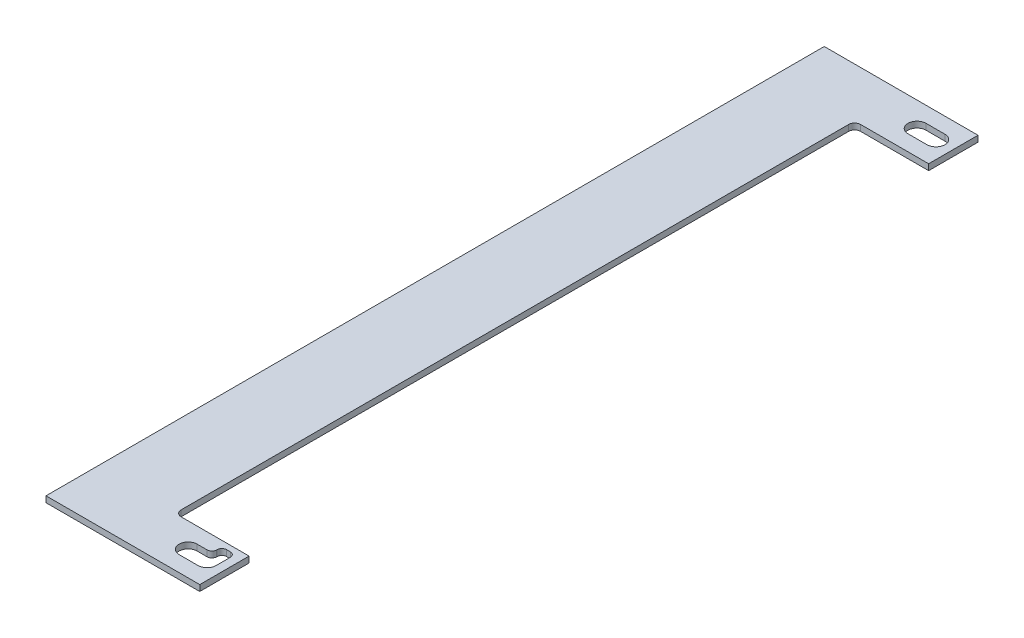
ISO-10303-21;
HEADER;
FILE_DESCRIPTION(('STEP AP214'),'2;1');
FILE_NAME('part.step','',(''),(''),'','','');
FILE_SCHEMA(('AUTOMOTIVE_DESIGN { 1 0 10303 214 1 1 1 1 }'));
ENDSEC;
DATA;
#1=APPLICATION_CONTEXT('core data for automotive mechanical design processes');
#2=APPLICATION_PROTOCOL_DEFINITION('international standard','automotive_design',2000,#1);
#3=PRODUCT_CONTEXT('',#1,'mechanical');
#4=PRODUCT('Part','Part','',(#3));
#5=PRODUCT_RELATED_PRODUCT_CATEGORY('part','',(#4));
#6=PRODUCT_DEFINITION_FORMATION('','',#4);
#7=PRODUCT_DEFINITION_CONTEXT('part definition',#1,'design');
#8=PRODUCT_DEFINITION('design','',#6,#7);
#9=PRODUCT_DEFINITION_SHAPE('','',#8);
#10=(LENGTH_UNIT() NAMED_UNIT(*) SI_UNIT(.MILLI.,.METRE.));
#11=(NAMED_UNIT(*) PLANE_ANGLE_UNIT() SI_UNIT($,.RADIAN.));
#12=(NAMED_UNIT(*) SI_UNIT($,.STERADIAN.) SOLID_ANGLE_UNIT());
#13=UNCERTAINTY_MEASURE_WITH_UNIT(LENGTH_MEASURE(1.E-05),#10,'distance_accuracy_value','');
#14=(GEOMETRIC_REPRESENTATION_CONTEXT(3) GLOBAL_UNCERTAINTY_ASSIGNED_CONTEXT((#13)) GLOBAL_UNIT_ASSIGNED_CONTEXT((#10,
#11,#12)) REPRESENTATION_CONTEXT('',''));
#15=CARTESIAN_POINT('',(0.,0.,0.));
#16=DIRECTION('',(0.,0.,1.));
#17=DIRECTION('',(1.,0.,0.));
#18=AXIS2_PLACEMENT_3D('',#15,#16,#17);
#19=CARTESIAN_POINT('',(2.,3.175,140.70025));
#20=DIRECTION('',(0.,-1.,0.));
#21=DIRECTION('',(0.,0.,-1.));
#22=AXIS2_PLACEMENT_3D('',#19,#20,#21);
#23=CYLINDRICAL_SURFACE('',#22,4.76250000000002);
#24=CARTESIAN_POINT('',(2.,3.175,140.70025));
#25=DIRECTION('',(0.,1.,0.));
#26=DIRECTION('',(0.,0.,1.));
#27=AXIS2_PLACEMENT_3D('',#24,#25,#26);
#28=CIRCLE('',#27,4.76250000000002);
#29=CARTESIAN_POINT('',(2.,3.175,145.46275));
#30=VERTEX_POINT('',#29);
#31=CARTESIAN_POINT('',(6.76250000000002,3.175,140.70025));
#32=VERTEX_POINT('',#31);
#33=EDGE_CURVE('E214',#30,#32,#28,.T.);
#34=ORIENTED_EDGE('',*,*,#33,.T.);
#35=DIRECTION('',(0.,1.,0.));
#36=VECTOR('',#35,1.);
#37=CARTESIAN_POINT('',(6.76250000000002,0.,140.70025));
#38=LINE('',#37,#36);
#39=CARTESIAN_POINT('',(6.76250000000002,0.,140.70025));
#40=VERTEX_POINT('',#39);
#41=EDGE_CURVE('E197',#40,#32,#38,.T.);
#42=ORIENTED_EDGE('',*,*,#41,.F.);
#43=CARTESIAN_POINT('',(2.,0.,140.70025));
#44=DIRECTION('',(0.,1.,0.));
#45=DIRECTION('',(0.,0.,1.));
#46=AXIS2_PLACEMENT_3D('',#43,#44,#45);
#47=CIRCLE('',#46,4.76250000000002);
#48=CARTESIAN_POINT('',(2.,0.,145.46275));
#49=VERTEX_POINT('',#48);
#50=EDGE_CURVE('E211',#49,#40,#47,.T.);
#51=ORIENTED_EDGE('',*,*,#50,.F.);
#52=DIRECTION('',(0.,-1.,0.));
#53=VECTOR('',#52,1.);
#54=CARTESIAN_POINT('',(2.,3.175,145.46275));
#55=LINE('',#54,#53);
#56=EDGE_CURVE('E232',#30,#49,#55,.T.);
#57=ORIENTED_EDGE('',*,*,#56,.F.);
#58=EDGE_LOOP('',(#34,#42,#51,#57));
#59=FACE_BOUND('',#58,.T.);
#60=ADVANCED_FACE('F34',(#59),#23,.F.);
#61=CARTESIAN_POINT('',(-69.865,3.175,153.70025));
#62=DIRECTION('',(0.,1.,0.));
#63=DIRECTION('',(0.,0.,1.));
#64=AXIS2_PLACEMENT_3D('',#61,#62,#63);
#65=PLANE('',#64);
#66=DIRECTION('',(-1.,0.,0.));
#67=VECTOR('',#66,1.);
#68=CARTESIAN_POINT('',(-8.,3.175,135.93775));
#69=LINE('',#68,#67);
#70=CARTESIAN_POINT('',(-2.73749999999998,3.175,135.93775));
#71=VERTEX_POINT('',#70);
#72=CARTESIAN_POINT('',(-8.,3.175,135.93775));
#73=VERTEX_POINT('',#72);
#74=EDGE_CURVE('E233',#71,#73,#69,.T.);
#75=ORIENTED_EDGE('',*,*,#74,.F.);
#76=CARTESIAN_POINT('',(-2.73749999999999,3.175,133.43775));
#77=DIRECTION('',(0.,1.,0.));
#78=DIRECTION('',(0.,0.,1.));
#79=AXIS2_PLACEMENT_3D('',#76,#77,#78);
#80=CIRCLE('',#79,2.5);
#81=CARTESIAN_POINT('',(-0.237499999999987,3.175,133.43775));
#82=VERTEX_POINT('',#81);
#83=EDGE_CURVE('E339',#71,#82,#80,.T.);
#84=ORIENTED_EDGE('',*,*,#83,.T.);
#85=DIRECTION('',(0.,0.,1.));
#86=VECTOR('',#85,1.);
#87=CARTESIAN_POINT('',(-0.237499999999987,3.175,135.93775));
#88=LINE('',#87,#86);
#89=CARTESIAN_POINT('',(-0.237499999999987,3.175,133.20025));
#90=VERTEX_POINT('',#89);
#91=EDGE_CURVE('E205',#90,#82,#88,.T.);
#92=ORIENTED_EDGE('',*,*,#91,.F.);
#93=CARTESIAN_POINT('',(2.26250000000001,3.175,133.20025));
#94=DIRECTION('',(0.,1.,0.));
#95=DIRECTION('',(0.,0.,1.));
#96=AXIS2_PLACEMENT_3D('',#93,#94,#95);
#97=CIRCLE('',#96,2.5);
#98=CARTESIAN_POINT('',(2.26250000000001,3.175,130.70025));
#99=VERTEX_POINT('',#98);
#100=EDGE_CURVE('E347',#90,#99,#97,.F.);
#101=ORIENTED_EDGE('',*,*,#100,.T.);
#102=DIRECTION('',(-1.,0.,0.));
#103=VECTOR('',#102,1.);
#104=CARTESIAN_POINT('',(-0.237499999999987,3.175,130.70025));
#105=LINE('',#104,#103);
#106=CARTESIAN_POINT('',(4.26250000000001,3.175,130.70025));
#107=VERTEX_POINT('',#106);
#108=EDGE_CURVE('E492',#107,#99,#105,.T.);
#109=ORIENTED_EDGE('',*,*,#108,.F.);
#110=CARTESIAN_POINT('',(4.26250000000001,3.175,133.20025));
#111=DIRECTION('',(0.,1.,0.));
#112=DIRECTION('',(0.,0.,1.));
#113=AXIS2_PLACEMENT_3D('',#110,#111,#112);
#114=CIRCLE('',#113,2.5);
#115=CARTESIAN_POINT('',(6.76250000000001,3.175,133.20025));
#116=VERTEX_POINT('',#115);
#117=EDGE_CURVE('E343',#107,#116,#114,.F.);
#118=ORIENTED_EDGE('',*,*,#117,.T.);
#119=DIRECTION('',(0.,0.,-1.));
#120=VECTOR('',#119,1.);
#121=CARTESIAN_POINT('',(6.76250000000001,3.175,130.70025));
#122=LINE('',#121,#120);
#123=EDGE_CURVE('E490',#32,#116,#122,.T.);
#124=ORIENTED_EDGE('',*,*,#123,.F.);
#125=ORIENTED_EDGE('',*,*,#33,.F.);
#126=DIRECTION('',(1.,0.,0.));
#127=VECTOR('',#126,1.);
#128=CARTESIAN_POINT('',(-8.,3.175,145.46275));
#129=LINE('',#128,#127);
#130=CARTESIAN_POINT('',(-8.,3.175,145.46275));
#131=VERTEX_POINT('',#130);
#132=EDGE_CURVE('E497',#131,#30,#129,.T.);
#133=ORIENTED_EDGE('',*,*,#132,.F.);
#134=CARTESIAN_POINT('',(-8.,3.175,140.70025));
#135=DIRECTION('',(0.,1.,0.));
#136=DIRECTION('',(0.,0.,1.));
#137=AXIS2_PLACEMENT_3D('',#134,#135,#136);
#138=CIRCLE('',#137,4.76250000000002);
#139=EDGE_CURVE('E224',#73,#131,#138,.T.);
#140=ORIENTED_EDGE('',*,*,#139,.F.);
#141=EDGE_LOOP('',(#75,#84,#92,#101,#109,#118,#124,#125,#133,#140));
#142=FACE_BOUND('',#141,.T.);
#143=DIRECTION('',(-1.,0.,0.));
#144=VECTOR('',#143,1.);
#145=CARTESIAN_POINT('',(-8.,3.175,-248.06225));
#146=LINE('',#145,#144);
#147=CARTESIAN_POINT('',(2.,3.175,-248.06225));
#148=VERTEX_POINT('',#147);
#149=CARTESIAN_POINT('',(-8.,3.175,-248.06225));
#150=VERTEX_POINT('',#149);
#151=EDGE_CURVE('E241',#148,#150,#146,.T.);
#152=ORIENTED_EDGE('',*,*,#151,.F.);
#153=CARTESIAN_POINT('',(2.,3.175,-243.29975));
#154=DIRECTION('',(0.,1.,0.));
#155=DIRECTION('',(0.,0.,1.));
#156=AXIS2_PLACEMENT_3D('',#153,#154,#155);
#157=CIRCLE('',#156,4.7625);
#158=CARTESIAN_POINT('',(2.,3.175,-238.53725));
#159=VERTEX_POINT('',#158);
#160=EDGE_CURVE('E239',#159,#148,#157,.T.);
#161=ORIENTED_EDGE('',*,*,#160,.F.);
#162=DIRECTION('',(1.,0.,0.));
#163=VECTOR('',#162,1.);
#164=CARTESIAN_POINT('',(-8.,3.175,-238.53725));
#165=LINE('',#164,#163);
#166=CARTESIAN_POINT('',(-8.,3.175,-238.53725));
#167=VERTEX_POINT('',#166);
#168=EDGE_CURVE('E247',#167,#159,#165,.T.);
#169=ORIENTED_EDGE('',*,*,#168,.F.);
#170=CARTESIAN_POINT('',(-8.,3.175,-243.29975));
#171=DIRECTION('',(0.,1.,0.));
#172=DIRECTION('',(0.,0.,1.));
#173=AXIS2_PLACEMENT_3D('',#170,#171,#172);
#174=CIRCLE('',#173,4.7625);
#175=EDGE_CURVE('E244',#150,#167,#174,.T.);
#176=ORIENTED_EDGE('',*,*,#175,.F.);
#177=EDGE_LOOP('',(#152,#161,#169,#176));
#178=FACE_BOUND('',#177,.T.);
#179=DIRECTION('',(0.,0.,1.));
#180=VECTOR('',#179,1.);
#181=CARTESIAN_POINT('',(-69.865,3.175,-256.29975));
#182=LINE('',#181,#180);
#183=CARTESIAN_POINT('',(-69.865,3.175,-256.29975));
#184=VERTEX_POINT('',#183);
#185=CARTESIAN_POINT('',(-69.865,3.175,153.70025));
#186=VERTEX_POINT('',#185);
#187=EDGE_CURVE('E270',#184,#186,#182,.T.);
#188=ORIENTED_EDGE('',*,*,#187,.T.);
#189=DIRECTION('',(1.,0.,0.));
#190=VECTOR('',#189,1.);
#191=CARTESIAN_POINT('',(-69.865,3.175,153.70025));
#192=LINE('',#191,#190);
#193=CARTESIAN_POINT('',(11.1350000000001,3.175,153.70025));
#194=VERTEX_POINT('',#193);
#195=EDGE_CURVE('E273',#186,#194,#192,.T.);
#196=ORIENTED_EDGE('',*,*,#195,.T.);
#197=DIRECTION('',(0.,0.,-1.));
#198=VECTOR('',#197,1.);
#199=CARTESIAN_POINT('',(11.1350000000001,3.175,145.46275));
#200=LINE('',#199,#198);
#201=CARTESIAN_POINT('',(11.1350000000001,3.175,127.70025));
#202=VERTEX_POINT('',#201);
#203=EDGE_CURVE('E276',#194,#202,#200,.T.);
#204=ORIENTED_EDGE('',*,*,#203,.T.);
#205=DIRECTION('',(-1.,0.,0.));
#206=VECTOR('',#205,1.);
#207=CARTESIAN_POINT('',(-27.865,3.175,127.70025));
#208=LINE('',#207,#206);
#209=CARTESIAN_POINT('',(-24.69,3.175,127.70025));
#210=VERTEX_POINT('',#209);
#211=EDGE_CURVE('E278',#202,#210,#208,.T.);
#212=ORIENTED_EDGE('',*,*,#211,.T.);
#213=CARTESIAN_POINT('',(-24.69,3.175,124.52525));
#214=DIRECTION('',(0.,1.,0.));
#215=DIRECTION('',(0.,0.,1.));
#216=AXIS2_PLACEMENT_3D('',#213,#214,#215);
#217=CIRCLE('',#216,3.175);
#218=CARTESIAN_POINT('',(-27.865,3.175,124.52525));
#219=VERTEX_POINT('',#218);
#220=EDGE_CURVE('E362',#210,#219,#217,.F.);
#221=ORIENTED_EDGE('',*,*,#220,.T.);
#222=DIRECTION('',(0.,0.,-1.));
#223=VECTOR('',#222,1.);
#224=CARTESIAN_POINT('',(-27.865,3.175,-230.29975));
#225=LINE('',#224,#223);
#226=CARTESIAN_POINT('',(-27.865,3.175,-227.12475));
#227=VERTEX_POINT('',#226);
#228=EDGE_CURVE('E281',#219,#227,#225,.T.);
#229=ORIENTED_EDGE('',*,*,#228,.T.);
#230=CARTESIAN_POINT('',(-24.69,3.175,-227.12475));
#231=DIRECTION('',(0.,1.,0.));
#232=DIRECTION('',(0.,0.,1.));
#233=AXIS2_PLACEMENT_3D('',#230,#231,#232);
#234=CIRCLE('',#233,3.175);
#235=CARTESIAN_POINT('',(-24.69,3.175,-230.29975));
#236=VERTEX_POINT('',#235);
#237=EDGE_CURVE('E11',#227,#236,#234,.F.);
#238=ORIENTED_EDGE('',*,*,#237,.T.);
#239=DIRECTION('',(1.,0.,0.));
#240=VECTOR('',#239,1.);
#241=CARTESIAN_POINT('',(11.135,3.175,-230.29975));
#242=LINE('',#241,#240);
#243=CARTESIAN_POINT('',(11.135,3.175,-230.29975));
#244=VERTEX_POINT('',#243);
#245=EDGE_CURVE('E283',#236,#244,#242,.T.);
#246=ORIENTED_EDGE('',*,*,#245,.T.);
#247=DIRECTION('',(0.,0.,-1.));
#248=VECTOR('',#247,1.);
#249=CARTESIAN_POINT('',(11.135,3.175,-238.53725));
#250=LINE('',#249,#248);
#251=CARTESIAN_POINT('',(11.135,3.175,-256.29975));
#252=VERTEX_POINT('',#251);
#253=EDGE_CURVE('E285',#244,#252,#250,.T.);
#254=ORIENTED_EDGE('',*,*,#253,.T.);
#255=DIRECTION('',(-1.,0.,0.));
#256=VECTOR('',#255,1.);
#257=CARTESIAN_POINT('',(-69.865,3.175,-256.29975));
#258=LINE('',#257,#256);
#259=EDGE_CURVE('E287',#252,#184,#258,.T.);
#260=ORIENTED_EDGE('',*,*,#259,.T.);
#261=EDGE_LOOP('',(#188,#196,#204,#212,#221,#229,#238,#246,#254,#260));
#262=FACE_BOUND('',#261,.T.);
#263=ADVANCED_FACE('F376',(#142,#178,#262),#65,.T.);
#264=CARTESIAN_POINT('',(-69.865,0.,153.70025));
#265=DIRECTION('',(0.,1.,0.));
#266=DIRECTION('',(0.,0.,1.));
#267=AXIS2_PLACEMENT_3D('',#264,#265,#266);
#268=PLANE('',#267);
#269=CARTESIAN_POINT('',(2.,0.,-243.29975));
#270=DIRECTION('',(0.,1.,0.));
#271=DIRECTION('',(0.,0.,1.));
#272=AXIS2_PLACEMENT_3D('',#269,#270,#271);
#273=CIRCLE('',#272,4.7625);
#274=CARTESIAN_POINT('',(2.,0.,-238.53725));
#275=VERTEX_POINT('',#274);
#276=CARTESIAN_POINT('',(2.,0.,-248.06225));
#277=VERTEX_POINT('',#276);
#278=EDGE_CURVE('E238',#275,#277,#273,.T.);
#279=ORIENTED_EDGE('',*,*,#278,.T.);
#280=DIRECTION('',(-1.,0.,0.));
#281=VECTOR('',#280,1.);
#282=CARTESIAN_POINT('',(-8.,0.,-248.06225));
#283=LINE('',#282,#281);
#284=CARTESIAN_POINT('',(-8.,0.,-248.06225));
#285=VERTEX_POINT('',#284);
#286=EDGE_CURVE('E252',#277,#285,#283,.T.);
#287=ORIENTED_EDGE('',*,*,#286,.T.);
#288=CARTESIAN_POINT('',(-8.,0.,-243.29975));
#289=DIRECTION('',(0.,1.,0.));
#290=DIRECTION('',(0.,0.,1.));
#291=AXIS2_PLACEMENT_3D('',#288,#289,#290);
#292=CIRCLE('',#291,4.7625);
#293=CARTESIAN_POINT('',(-8.,0.,-238.53725));
#294=VERTEX_POINT('',#293);
#295=EDGE_CURVE('E255',#285,#294,#292,.T.);
#296=ORIENTED_EDGE('',*,*,#295,.T.);
#297=DIRECTION('',(1.,0.,0.));
#298=VECTOR('',#297,1.);
#299=CARTESIAN_POINT('',(-8.,0.,-238.53725));
#300=LINE('',#299,#298);
#301=EDGE_CURVE('E242',#294,#275,#300,.T.);
#302=ORIENTED_EDGE('',*,*,#301,.T.);
#303=EDGE_LOOP('',(#279,#287,#296,#302));
#304=FACE_BOUND('',#303,.T.);
#305=DIRECTION('',(0.,0.,1.));
#306=VECTOR('',#305,1.);
#307=CARTESIAN_POINT('',(-69.865,0.,-256.29975));
#308=LINE('',#307,#306);
#309=CARTESIAN_POINT('',(-69.865,0.,-256.29975));
#310=VERTEX_POINT('',#309);
#311=CARTESIAN_POINT('',(-69.865,0.,153.70025));
#312=VERTEX_POINT('',#311);
#313=EDGE_CURVE('E269',#310,#312,#308,.T.);
#314=ORIENTED_EDGE('',*,*,#313,.F.);
#315=DIRECTION('',(-1.,0.,0.));
#316=VECTOR('',#315,1.);
#317=CARTESIAN_POINT('',(-69.865,0.,-256.29975));
#318=LINE('',#317,#316);
#319=CARTESIAN_POINT('',(11.135,0.,-256.29975));
#320=VERTEX_POINT('',#319);
#321=EDGE_CURVE('E274',#320,#310,#318,.T.);
#322=ORIENTED_EDGE('',*,*,#321,.F.);
#323=DIRECTION('',(0.,0.,-1.));
#324=VECTOR('',#323,1.);
#325=CARTESIAN_POINT('',(11.135,0.,-256.29975));
#326=LINE('',#325,#324);
#327=CARTESIAN_POINT('',(11.135,0.,-230.29975));
#328=VERTEX_POINT('',#327);
#329=EDGE_CURVE('E305',#328,#320,#326,.T.);
#330=ORIENTED_EDGE('',*,*,#329,.F.);
#331=DIRECTION('',(1.,0.,0.));
#332=VECTOR('',#331,1.);
#333=CARTESIAN_POINT('',(11.135,0.,-230.29975));
#334=LINE('',#333,#332);
#335=CARTESIAN_POINT('',(-24.69,0.,-230.29975));
#336=VERTEX_POINT('',#335);
#337=EDGE_CURVE('E303',#336,#328,#334,.T.);
#338=ORIENTED_EDGE('',*,*,#337,.F.);
#339=CARTESIAN_POINT('',(-24.69,0.,-227.12475));
#340=DIRECTION('',(0.,1.,0.));
#341=DIRECTION('',(0.,0.,1.));
#342=AXIS2_PLACEMENT_3D('',#339,#340,#341);
#343=CIRCLE('',#342,3.175);
#344=CARTESIAN_POINT('',(-27.865,0.,-227.12475));
#345=VERTEX_POINT('',#344);
#346=EDGE_CURVE('E42',#336,#345,#343,.T.);
#347=ORIENTED_EDGE('',*,*,#346,.T.);
#348=DIRECTION('',(0.,0.,-1.));
#349=VECTOR('',#348,1.);
#350=CARTESIAN_POINT('',(-27.865,0.,-230.29975));
#351=LINE('',#350,#349);
#352=CARTESIAN_POINT('',(-27.865,0.,124.52525));
#353=VERTEX_POINT('',#352);
#354=EDGE_CURVE('E300',#353,#345,#351,.T.);
#355=ORIENTED_EDGE('',*,*,#354,.F.);
#356=CARTESIAN_POINT('',(-24.69,0.,124.52525));
#357=DIRECTION('',(0.,1.,0.));
#358=DIRECTION('',(0.,0.,1.));
#359=AXIS2_PLACEMENT_3D('',#356,#357,#358);
#360=CIRCLE('',#359,3.175);
#361=CARTESIAN_POINT('',(-24.69,0.,127.70025));
#362=VERTEX_POINT('',#361);
#363=EDGE_CURVE('E360',#353,#362,#360,.T.);
#364=ORIENTED_EDGE('',*,*,#363,.T.);
#365=DIRECTION('',(-1.,0.,0.));
#366=VECTOR('',#365,1.);
#367=CARTESIAN_POINT('',(-27.865,0.,127.70025));
#368=LINE('',#367,#366);
#369=CARTESIAN_POINT('',(11.1350000000001,0.,127.70025));
#370=VERTEX_POINT('',#369);
#371=EDGE_CURVE('E297',#370,#362,#368,.T.);
#372=ORIENTED_EDGE('',*,*,#371,.F.);
#373=DIRECTION('',(0.,0.,-1.));
#374=VECTOR('',#373,1.);
#375=CARTESIAN_POINT('',(11.1350000000001,0.,127.70025));
#376=LINE('',#375,#374);
#377=CARTESIAN_POINT('',(11.1350000000001,0.,153.70025));
#378=VERTEX_POINT('',#377);
#379=EDGE_CURVE('E295',#378,#370,#376,.T.);
#380=ORIENTED_EDGE('',*,*,#379,.F.);
#381=DIRECTION('',(1.,0.,0.));
#382=VECTOR('',#381,1.);
#383=CARTESIAN_POINT('',(-69.865,0.,153.70025));
#384=LINE('',#383,#382);
#385=EDGE_CURVE('E292',#312,#378,#384,.T.);
#386=ORIENTED_EDGE('',*,*,#385,.F.);
#387=EDGE_LOOP('',(#314,#322,#330,#338,#347,#355,#364,#372,#380,#386));
#388=FACE_BOUND('',#387,.T.);
#389=DIRECTION('',(0.,0.,1.));
#390=VECTOR('',#389,1.);
#391=CARTESIAN_POINT('',(-0.237499999999987,0.,135.93775));
#392=LINE('',#391,#390);
#393=CARTESIAN_POINT('',(-0.237499999999987,0.,133.20025));
#394=VERTEX_POINT('',#393);
#395=CARTESIAN_POINT('',(-0.237499999999987,0.,133.43775));
#396=VERTEX_POINT('',#395);
#397=EDGE_CURVE('E216',#394,#396,#392,.T.);
#398=ORIENTED_EDGE('',*,*,#397,.T.);
#399=CARTESIAN_POINT('',(-2.73749999999999,0.,133.43775));
#400=DIRECTION('',(0.,1.,0.));
#401=DIRECTION('',(0.,0.,1.));
#402=AXIS2_PLACEMENT_3D('',#399,#400,#401);
#403=CIRCLE('',#402,2.5);
#404=CARTESIAN_POINT('',(-2.73749999999998,0.,135.93775));
#405=VERTEX_POINT('',#404);
#406=EDGE_CURVE('E341',#396,#405,#403,.F.);
#407=ORIENTED_EDGE('',*,*,#406,.T.);
#408=DIRECTION('',(-1.,0.,0.));
#409=VECTOR('',#408,1.);
#410=CARTESIAN_POINT('',(-8.,0.,135.93775));
#411=LINE('',#410,#409);
#412=CARTESIAN_POINT('',(-8.,0.,135.93775));
#413=VERTEX_POINT('',#412);
#414=EDGE_CURVE('E222',#405,#413,#411,.T.);
#415=ORIENTED_EDGE('',*,*,#414,.T.);
#416=CARTESIAN_POINT('',(-8.,0.,140.70025));
#417=DIRECTION('',(0.,1.,0.));
#418=DIRECTION('',(0.,0.,1.));
#419=AXIS2_PLACEMENT_3D('',#416,#417,#418);
#420=CIRCLE('',#419,4.76250000000002);
#421=CARTESIAN_POINT('',(-8.,0.,145.46275));
#422=VERTEX_POINT('',#421);
#423=EDGE_CURVE('E215',#413,#422,#420,.T.);
#424=ORIENTED_EDGE('',*,*,#423,.T.);
#425=DIRECTION('',(1.,0.,0.));
#426=VECTOR('',#425,1.);
#427=CARTESIAN_POINT('',(-8.,0.,145.46275));
#428=LINE('',#427,#426);
#429=EDGE_CURVE('E221',#422,#49,#428,.T.);
#430=ORIENTED_EDGE('',*,*,#429,.T.);
#431=ORIENTED_EDGE('',*,*,#50,.T.);
#432=DIRECTION('',(0.,0.,-1.));
#433=VECTOR('',#432,1.);
#434=CARTESIAN_POINT('',(6.76250000000001,0.,130.70025));
#435=LINE('',#434,#433);
#436=CARTESIAN_POINT('',(6.76250000000001,0.,133.20025));
#437=VERTEX_POINT('',#436);
#438=EDGE_CURVE('E193',#40,#437,#435,.T.);
#439=ORIENTED_EDGE('',*,*,#438,.T.);
#440=CARTESIAN_POINT('',(4.26250000000001,0.,133.20025));
#441=DIRECTION('',(0.,1.,0.));
#442=DIRECTION('',(0.,0.,1.));
#443=AXIS2_PLACEMENT_3D('',#440,#441,#442);
#444=CIRCLE('',#443,2.5);
#445=CARTESIAN_POINT('',(4.26250000000001,0.,130.70025));
#446=VERTEX_POINT('',#445);
#447=EDGE_CURVE('E345',#437,#446,#444,.T.);
#448=ORIENTED_EDGE('',*,*,#447,.T.);
#449=DIRECTION('',(-1.,0.,0.));
#450=VECTOR('',#449,1.);
#451=CARTESIAN_POINT('',(-0.237499999999987,0.,130.70025));
#452=LINE('',#451,#450);
#453=CARTESIAN_POINT('',(2.26250000000001,0.,130.70025));
#454=VERTEX_POINT('',#453);
#455=EDGE_CURVE('E204',#446,#454,#452,.T.);
#456=ORIENTED_EDGE('',*,*,#455,.T.);
#457=CARTESIAN_POINT('',(2.26250000000001,0.,133.20025));
#458=DIRECTION('',(0.,1.,0.));
#459=DIRECTION('',(0.,0.,1.));
#460=AXIS2_PLACEMENT_3D('',#457,#458,#459);
#461=CIRCLE('',#460,2.5);
#462=EDGE_CURVE('E349',#454,#394,#461,.T.);
#463=ORIENTED_EDGE('',*,*,#462,.T.);
#464=EDGE_LOOP('',(#398,#407,#415,#424,#430,#431,#439,#448,#456,#463));
#465=FACE_BOUND('',#464,.T.);
#466=ADVANCED_FACE('F219',(#304,#388,#465),#268,.F.);
#467=CARTESIAN_POINT('',(-69.865,3.175,-256.29975));
#468=DIRECTION('',(1.,0.,0.));
#469=DIRECTION('',(0.,0.,-1.));
#470=AXIS2_PLACEMENT_3D('',#467,#468,#469);
#471=PLANE('',#470);
#472=ORIENTED_EDGE('',*,*,#313,.T.);
#473=DIRECTION('',(0.,-1.,0.));
#474=VECTOR('',#473,1.);
#475=CARTESIAN_POINT('',(-69.865,3.175,153.70025));
#476=LINE('',#475,#474);
#477=EDGE_CURVE('E322',#186,#312,#476,.T.);
#478=ORIENTED_EDGE('',*,*,#477,.F.);
#479=ORIENTED_EDGE('',*,*,#187,.F.);
#480=DIRECTION('',(0.,-1.,0.));
#481=VECTOR('',#480,1.);
#482=CARTESIAN_POINT('',(-69.865,3.175,-256.29975));
#483=LINE('',#482,#481);
#484=EDGE_CURVE('E289',#184,#310,#483,.T.);
#485=ORIENTED_EDGE('',*,*,#484,.T.);
#486=EDGE_LOOP('',(#472,#478,#479,#485));
#487=FACE_BOUND('',#486,.T.);
#488=ADVANCED_FACE('F388',(#487),#471,.F.);
#489=CARTESIAN_POINT('',(-69.865,3.175,153.70025));
#490=DIRECTION('',(0.,0.,-1.));
#491=DIRECTION('',(-1.,0.,0.));
#492=AXIS2_PLACEMENT_3D('',#489,#490,#491);
#493=PLANE('',#492);
#494=ORIENTED_EDGE('',*,*,#385,.T.);
#495=DIRECTION('',(0.,-1.,0.));
#496=VECTOR('',#495,1.);
#497=CARTESIAN_POINT('',(11.1350000000001,3.175,153.70025));
#498=LINE('',#497,#496);
#499=EDGE_CURVE('E319',#194,#378,#498,.T.);
#500=ORIENTED_EDGE('',*,*,#499,.F.);
#501=ORIENTED_EDGE('',*,*,#195,.F.);
#502=ORIENTED_EDGE('',*,*,#477,.T.);
#503=EDGE_LOOP('',(#494,#500,#501,#502));
#504=FACE_BOUND('',#503,.T.);
#505=ADVANCED_FACE('F393',(#504),#493,.F.);
#506=CARTESIAN_POINT('',(11.1350000000001,3.175,127.70025));
#507=DIRECTION('',(-1.,0.,0.));
#508=DIRECTION('',(0.,0.,1.));
#509=AXIS2_PLACEMENT_3D('',#506,#507,#508);
#510=PLANE('',#509);
#511=ORIENTED_EDGE('',*,*,#379,.T.);
#512=DIRECTION('',(0.,-1.,0.));
#513=VECTOR('',#512,1.);
#514=CARTESIAN_POINT('',(11.1350000000001,3.175,127.70025));
#515=LINE('',#514,#513);
#516=EDGE_CURVE('E316',#202,#370,#515,.T.);
#517=ORIENTED_EDGE('',*,*,#516,.F.);
#518=ORIENTED_EDGE('',*,*,#203,.F.);
#519=ORIENTED_EDGE('',*,*,#499,.T.);
#520=EDGE_LOOP('',(#511,#517,#518,#519));
#521=FACE_BOUND('',#520,.T.);
#522=ADVANCED_FACE('F395',(#521),#510,.F.);
#523=CARTESIAN_POINT('',(-27.865,3.175,127.70025));
#524=DIRECTION('',(0.,0.,1.));
#525=DIRECTION('',(1.,0.,0.));
#526=AXIS2_PLACEMENT_3D('',#523,#524,#525);
#527=PLANE('',#526);
#528=ORIENTED_EDGE('',*,*,#371,.T.);
#529=DIRECTION('',(0.,-1.,0.));
#530=VECTOR('',#529,1.);
#531=CARTESIAN_POINT('',(-24.69,3.175,127.70025));
#532=LINE('',#531,#530);
#533=EDGE_CURVE('E356',#362,#210,#532,.F.);
#534=ORIENTED_EDGE('',*,*,#533,.T.);
#535=ORIENTED_EDGE('',*,*,#211,.F.);
#536=ORIENTED_EDGE('',*,*,#516,.T.);
#537=EDGE_LOOP('',(#528,#534,#535,#536));
#538=FACE_BOUND('',#537,.T.);
#539=ADVANCED_FACE('F399',(#538),#527,.F.);
#540=CARTESIAN_POINT('',(-27.865,3.175,-230.29975));
#541=DIRECTION('',(-1.,0.,0.));
#542=DIRECTION('',(0.,0.,1.));
#543=AXIS2_PLACEMENT_3D('',#540,#541,#542);
#544=PLANE('',#543);
#545=ORIENTED_EDGE('',*,*,#228,.F.);
#546=DIRECTION('',(0.,-1.,0.));
#547=VECTOR('',#546,1.);
#548=CARTESIAN_POINT('',(-27.865,0.,124.52525));
#549=LINE('',#548,#547);
#550=EDGE_CURVE('E353',#219,#353,#549,.T.);
#551=ORIENTED_EDGE('',*,*,#550,.T.);
#552=ORIENTED_EDGE('',*,*,#354,.T.);
#553=DIRECTION('',(0.,-1.,0.));
#554=VECTOR('',#553,1.);
#555=CARTESIAN_POINT('',(-27.865,3.175,-227.12475));
#556=LINE('',#555,#554);
#557=EDGE_CURVE('E351',#345,#227,#556,.F.);
#558=ORIENTED_EDGE('',*,*,#557,.T.);
#559=EDGE_LOOP('',(#545,#551,#552,#558));
#560=FACE_BOUND('',#559,.T.);
#561=ADVANCED_FACE('F370',(#560),#544,.F.);
#562=CARTESIAN_POINT('',(11.135,3.175,-230.29975));
#563=DIRECTION('',(0.,0.,-1.));
#564=DIRECTION('',(-1.,0.,0.));
#565=AXIS2_PLACEMENT_3D('',#562,#563,#564);
#566=PLANE('',#565);
#567=ORIENTED_EDGE('',*,*,#245,.F.);
#568=DIRECTION('',(0.,-1.,0.));
#569=VECTOR('',#568,1.);
#570=CARTESIAN_POINT('',(-24.69,0.,-230.29975));
#571=LINE('',#570,#569);
#572=EDGE_CURVE('E358',#236,#336,#571,.T.);
#573=ORIENTED_EDGE('',*,*,#572,.T.);
#574=ORIENTED_EDGE('',*,*,#337,.T.);
#575=DIRECTION('',(0.,-1.,0.));
#576=VECTOR('',#575,1.);
#577=CARTESIAN_POINT('',(11.135,3.175,-230.29975));
#578=LINE('',#577,#576);
#579=EDGE_CURVE('E313',#244,#328,#578,.T.);
#580=ORIENTED_EDGE('',*,*,#579,.F.);
#581=EDGE_LOOP('',(#567,#573,#574,#580));
#582=FACE_BOUND('',#581,.T.);
#583=ADVANCED_FACE('F373',(#582),#566,.F.);
#584=CARTESIAN_POINT('',(11.135,3.175,-256.29975));
#585=DIRECTION('',(-1.,0.,0.));
#586=DIRECTION('',(0.,0.,1.));
#587=AXIS2_PLACEMENT_3D('',#584,#585,#586);
#588=PLANE('',#587);
#589=ORIENTED_EDGE('',*,*,#329,.T.);
#590=DIRECTION('',(0.,-1.,0.));
#591=VECTOR('',#590,1.);
#592=CARTESIAN_POINT('',(11.135,3.175,-256.29975));
#593=LINE('',#592,#591);
#594=EDGE_CURVE('E310',#252,#320,#593,.T.);
#595=ORIENTED_EDGE('',*,*,#594,.F.);
#596=ORIENTED_EDGE('',*,*,#253,.F.);
#597=ORIENTED_EDGE('',*,*,#579,.T.);
#598=EDGE_LOOP('',(#589,#595,#596,#597));
#599=FACE_BOUND('',#598,.T.);
#600=ADVANCED_FACE('F381',(#599),#588,.F.);
#601=CARTESIAN_POINT('',(-69.865,3.175,-256.29975));
#602=DIRECTION('',(0.,0.,1.));
#603=DIRECTION('',(1.,0.,0.));
#604=AXIS2_PLACEMENT_3D('',#601,#602,#603);
#605=PLANE('',#604);
#606=ORIENTED_EDGE('',*,*,#321,.T.);
#607=ORIENTED_EDGE('',*,*,#484,.F.);
#608=ORIENTED_EDGE('',*,*,#259,.F.);
#609=ORIENTED_EDGE('',*,*,#594,.T.);
#610=EDGE_LOOP('',(#606,#607,#608,#609));
#611=FACE_BOUND('',#610,.T.);
#612=ADVANCED_FACE('F384',(#611),#605,.F.);
#613=CARTESIAN_POINT('',(2.,3.175,-243.29975));
#614=DIRECTION('',(0.,-1.,0.));
#615=DIRECTION('',(0.,0.,-1.));
#616=AXIS2_PLACEMENT_3D('',#613,#614,#615);
#617=CYLINDRICAL_SURFACE('',#616,4.7625);
#618=ORIENTED_EDGE('',*,*,#278,.F.);
#619=DIRECTION('',(0.,-1.,0.));
#620=VECTOR('',#619,1.);
#621=CARTESIAN_POINT('',(2.,3.175,-238.53725));
#622=LINE('',#621,#620);
#623=EDGE_CURVE('E249',#159,#275,#622,.T.);
#624=ORIENTED_EDGE('',*,*,#623,.F.);
#625=ORIENTED_EDGE('',*,*,#160,.T.);
#626=DIRECTION('',(0.,-1.,0.));
#627=VECTOR('',#626,1.);
#628=CARTESIAN_POINT('',(2.,3.175,-248.06225));
#629=LINE('',#628,#627);
#630=EDGE_CURVE('E266',#148,#277,#629,.T.);
#631=ORIENTED_EDGE('',*,*,#630,.T.);
#632=EDGE_LOOP('',(#618,#624,#625,#631));
#633=FACE_BOUND('',#632,.T.);
#634=ADVANCED_FACE('F443',(#633),#617,.F.);
#635=CARTESIAN_POINT('',(-8.,3.175,-248.06225));
#636=DIRECTION('',(0.,0.,1.));
#637=DIRECTION('',(1.,0.,0.));
#638=AXIS2_PLACEMENT_3D('',#635,#636,#637);
#639=PLANE('',#638);
#640=ORIENTED_EDGE('',*,*,#286,.F.);
#641=ORIENTED_EDGE('',*,*,#630,.F.);
#642=ORIENTED_EDGE('',*,*,#151,.T.);
#643=DIRECTION('',(0.,-1.,0.));
#644=VECTOR('',#643,1.);
#645=CARTESIAN_POINT('',(-8.,3.175,-248.06225));
#646=LINE('',#645,#644);
#647=EDGE_CURVE('E264',#150,#285,#646,.T.);
#648=ORIENTED_EDGE('',*,*,#647,.T.);
#649=EDGE_LOOP('',(#640,#641,#642,#648));
#650=FACE_BOUND('',#649,.T.);
#651=ADVANCED_FACE('F439',(#650),#639,.T.);
#652=CARTESIAN_POINT('',(-8.,3.175,-243.29975));
#653=DIRECTION('',(0.,-1.,0.));
#654=DIRECTION('',(0.,0.,-1.));
#655=AXIS2_PLACEMENT_3D('',#652,#653,#654);
#656=CYLINDRICAL_SURFACE('',#655,4.7625);
#657=ORIENTED_EDGE('',*,*,#295,.F.);
#658=ORIENTED_EDGE('',*,*,#647,.F.);
#659=ORIENTED_EDGE('',*,*,#175,.T.);
#660=DIRECTION('',(0.,-1.,0.));
#661=VECTOR('',#660,1.);
#662=CARTESIAN_POINT('',(-8.,3.175,-238.53725));
#663=LINE('',#662,#661);
#664=EDGE_CURVE('E262',#167,#294,#663,.T.);
#665=ORIENTED_EDGE('',*,*,#664,.T.);
#666=EDGE_LOOP('',(#657,#658,#659,#665));
#667=FACE_BOUND('',#666,.T.);
#668=ADVANCED_FACE('F435',(#667),#656,.F.);
#669=CARTESIAN_POINT('',(-8.,3.175,-238.53725));
#670=DIRECTION('',(0.,0.,-1.));
#671=DIRECTION('',(-1.,0.,0.));
#672=AXIS2_PLACEMENT_3D('',#669,#670,#671);
#673=PLANE('',#672);
#674=ORIENTED_EDGE('',*,*,#301,.F.);
#675=ORIENTED_EDGE('',*,*,#664,.F.);
#676=ORIENTED_EDGE('',*,*,#168,.T.);
#677=ORIENTED_EDGE('',*,*,#623,.T.);
#678=EDGE_LOOP('',(#674,#675,#676,#677));
#679=FACE_BOUND('',#678,.T.);
#680=ADVANCED_FACE('F431',(#679),#673,.T.);
#681=CARTESIAN_POINT('',(-8.,3.175,140.70025));
#682=DIRECTION('',(0.,-1.,0.));
#683=DIRECTION('',(0.,0.,-1.));
#684=AXIS2_PLACEMENT_3D('',#681,#682,#683);
#685=CYLINDRICAL_SURFACE('',#684,4.76250000000002);
#686=ORIENTED_EDGE('',*,*,#423,.F.);
#687=DIRECTION('',(0.,-1.,0.));
#688=VECTOR('',#687,1.);
#689=CARTESIAN_POINT('',(-8.,3.175,135.93775));
#690=LINE('',#689,#688);
#691=EDGE_CURVE('E229',#73,#413,#690,.T.);
#692=ORIENTED_EDGE('',*,*,#691,.F.);
#693=ORIENTED_EDGE('',*,*,#139,.T.);
#694=DIRECTION('',(0.,-1.,0.));
#695=VECTOR('',#694,1.);
#696=CARTESIAN_POINT('',(-8.,3.175,145.46275));
#697=LINE('',#696,#695);
#698=EDGE_CURVE('E235',#131,#422,#697,.T.);
#699=ORIENTED_EDGE('',*,*,#698,.T.);
#700=EDGE_LOOP('',(#686,#692,#693,#699));
#701=FACE_BOUND('',#700,.T.);
#702=ADVANCED_FACE('F427',(#701),#685,.F.);
#703=CARTESIAN_POINT('',(-8.,3.175,145.46275));
#704=DIRECTION('',(0.,0.,-1.));
#705=DIRECTION('',(-1.,0.,0.));
#706=AXIS2_PLACEMENT_3D('',#703,#704,#705);
#707=PLANE('',#706);
#708=ORIENTED_EDGE('',*,*,#429,.F.);
#709=ORIENTED_EDGE('',*,*,#698,.F.);
#710=ORIENTED_EDGE('',*,*,#132,.T.);
#711=ORIENTED_EDGE('',*,*,#56,.T.);
#712=EDGE_LOOP('',(#708,#709,#710,#711));
#713=FACE_BOUND('',#712,.T.);
#714=ADVANCED_FACE('F424',(#713),#707,.T.);
#715=CARTESIAN_POINT('',(-8.,3.175,135.93775));
#716=DIRECTION('',(0.,0.,1.));
#717=DIRECTION('',(1.,0.,0.));
#718=AXIS2_PLACEMENT_3D('',#715,#716,#717);
#719=PLANE('',#718);
#720=ORIENTED_EDGE('',*,*,#414,.F.);
#721=DIRECTION('',(0.,1.,0.));
#722=VECTOR('',#721,1.);
#723=CARTESIAN_POINT('',(-2.73749999999998,3.175,135.93775));
#724=LINE('',#723,#722);
#725=EDGE_CURVE('E336',#405,#71,#724,.T.);
#726=ORIENTED_EDGE('',*,*,#725,.T.);
#727=ORIENTED_EDGE('',*,*,#74,.T.);
#728=ORIENTED_EDGE('',*,*,#691,.T.);
#729=EDGE_LOOP('',(#720,#726,#727,#728));
#730=FACE_BOUND('',#729,.T.);
#731=ADVANCED_FACE('F422',(#730),#719,.T.);
#732=CARTESIAN_POINT('',(-0.237499999999987,0.,135.93775));
#733=DIRECTION('',(-1.,0.,0.));
#734=DIRECTION('',(0.,0.,1.));
#735=AXIS2_PLACEMENT_3D('',#732,#733,#734);
#736=PLANE('',#735);
#737=ORIENTED_EDGE('',*,*,#397,.F.);
#738=DIRECTION('',(0.,1.,0.));
#739=VECTOR('',#738,1.);
#740=CARTESIAN_POINT('',(-0.237499999999987,3.175,133.20025));
#741=LINE('',#740,#739);
#742=EDGE_CURVE('E333',#394,#90,#741,.T.);
#743=ORIENTED_EDGE('',*,*,#742,.T.);
#744=ORIENTED_EDGE('',*,*,#91,.T.);
#745=DIRECTION('',(0.,1.,0.));
#746=VECTOR('',#745,1.);
#747=CARTESIAN_POINT('',(-0.237499999999987,0.,133.43775));
#748=LINE('',#747,#746);
#749=EDGE_CURVE('E331',#82,#396,#748,.F.);
#750=ORIENTED_EDGE('',*,*,#749,.T.);
#751=EDGE_LOOP('',(#737,#743,#744,#750));
#752=FACE_BOUND('',#751,.T.);
#753=ADVANCED_FACE('F483',(#752),#736,.F.);
#754=CARTESIAN_POINT('',(-0.237499999999987,0.,130.70025));
#755=DIRECTION('',(0.,0.,-1.));
#756=DIRECTION('',(-1.,0.,0.));
#757=AXIS2_PLACEMENT_3D('',#754,#755,#756);
#758=PLANE('',#757);
#759=ORIENTED_EDGE('',*,*,#455,.F.);
#760=DIRECTION('',(0.,1.,0.));
#761=VECTOR('',#760,1.);
#762=CARTESIAN_POINT('',(4.26250000000001,3.175,130.70025));
#763=LINE('',#762,#761);
#764=EDGE_CURVE('E327',#446,#107,#763,.T.);
#765=ORIENTED_EDGE('',*,*,#764,.T.);
#766=ORIENTED_EDGE('',*,*,#108,.T.);
#767=DIRECTION('',(0.,1.,0.));
#768=VECTOR('',#767,1.);
#769=CARTESIAN_POINT('',(2.26250000000001,0.,130.70025));
#770=LINE('',#769,#768);
#771=EDGE_CURVE('E325',#99,#454,#770,.F.);
#772=ORIENTED_EDGE('',*,*,#771,.T.);
#773=EDGE_LOOP('',(#759,#765,#766,#772));
#774=FACE_BOUND('',#773,.T.);
#775=ADVANCED_FACE('F513',(#774),#758,.F.);
#776=CARTESIAN_POINT('',(6.76250000000001,0.,130.70025));
#777=DIRECTION('',(1.,0.,0.));
#778=DIRECTION('',(0.,0.,-1.));
#779=AXIS2_PLACEMENT_3D('',#776,#777,#778);
#780=PLANE('',#779);
#781=ORIENTED_EDGE('',*,*,#123,.T.);
#782=DIRECTION('',(0.,1.,0.));
#783=VECTOR('',#782,1.);
#784=CARTESIAN_POINT('',(6.76250000000001,0.,133.20025));
#785=LINE('',#784,#783);
#786=EDGE_CURVE('E200',#116,#437,#785,.F.);
#787=ORIENTED_EDGE('',*,*,#786,.T.);
#788=ORIENTED_EDGE('',*,*,#438,.F.);
#789=ORIENTED_EDGE('',*,*,#41,.T.);
#790=EDGE_LOOP('',(#781,#787,#788,#789));
#791=FACE_BOUND('',#790,.T.);
#792=ADVANCED_FACE('F196',(#791),#780,.F.);
#793=CARTESIAN_POINT('',(4.26250000000001,0.,133.20025));
#794=DIRECTION('',(0.,-1.,0.));
#795=DIRECTION('',(0.,0.,-1.));
#796=AXIS2_PLACEMENT_3D('',#793,#794,#795);
#797=CYLINDRICAL_SURFACE('',#796,2.5);
#798=ORIENTED_EDGE('',*,*,#447,.F.);
#799=ORIENTED_EDGE('',*,*,#786,.F.);
#800=ORIENTED_EDGE('',*,*,#117,.F.);
#801=ORIENTED_EDGE('',*,*,#764,.F.);
#802=EDGE_LOOP('',(#798,#799,#800,#801));
#803=FACE_BOUND('',#802,.T.);
#804=ADVANCED_FACE('F467',(#803),#797,.F.);
#805=CARTESIAN_POINT('',(2.26250000000001,0.,133.20025));
#806=DIRECTION('',(0.,-1.,0.));
#807=DIRECTION('',(0.,0.,-1.));
#808=AXIS2_PLACEMENT_3D('',#805,#806,#807);
#809=CYLINDRICAL_SURFACE('',#808,2.5);
#810=ORIENTED_EDGE('',*,*,#462,.F.);
#811=ORIENTED_EDGE('',*,*,#771,.F.);
#812=ORIENTED_EDGE('',*,*,#100,.F.);
#813=ORIENTED_EDGE('',*,*,#742,.F.);
#814=EDGE_LOOP('',(#810,#811,#812,#813));
#815=FACE_BOUND('',#814,.T.);
#816=ADVANCED_FACE('F410',(#815),#809,.F.);
#817=CARTESIAN_POINT('',(-2.73749999999999,3.175,133.43775));
#818=DIRECTION('',(0.,-1.,0.));
#819=DIRECTION('',(0.,0.,-1.));
#820=AXIS2_PLACEMENT_3D('',#817,#818,#819);
#821=CYLINDRICAL_SURFACE('',#820,2.5);
#822=ORIENTED_EDGE('',*,*,#406,.F.);
#823=ORIENTED_EDGE('',*,*,#749,.F.);
#824=ORIENTED_EDGE('',*,*,#83,.F.);
#825=ORIENTED_EDGE('',*,*,#725,.F.);
#826=EDGE_LOOP('',(#822,#823,#824,#825));
#827=FACE_BOUND('',#826,.T.);
#828=ADVANCED_FACE('F405',(#827),#821,.T.);
#829=CARTESIAN_POINT('',(-24.69,3.175,124.52525));
#830=DIRECTION('',(0.,1.,0.));
#831=DIRECTION('',(0.,0.,1.));
#832=AXIS2_PLACEMENT_3D('',#829,#830,#831);
#833=CYLINDRICAL_SURFACE('',#832,3.175);
#834=ORIENTED_EDGE('',*,*,#220,.F.);
#835=ORIENTED_EDGE('',*,*,#533,.F.);
#836=ORIENTED_EDGE('',*,*,#363,.F.);
#837=ORIENTED_EDGE('',*,*,#550,.F.);
#838=EDGE_LOOP('',(#834,#835,#836,#837));
#839=FACE_BOUND('',#838,.T.);
#840=ADVANCED_FACE('F403',(#839),#833,.F.);
#841=CARTESIAN_POINT('',(-24.69,3.175,-227.12475));
#842=DIRECTION('',(0.,1.,0.));
#843=DIRECTION('',(0.,0.,1.));
#844=AXIS2_PLACEMENT_3D('',#841,#842,#843);
#845=CYLINDRICAL_SURFACE('',#844,3.175);
#846=ORIENTED_EDGE('',*,*,#237,.F.);
#847=ORIENTED_EDGE('',*,*,#557,.F.);
#848=ORIENTED_EDGE('',*,*,#346,.F.);
#849=ORIENTED_EDGE('',*,*,#572,.F.);
#850=EDGE_LOOP('',(#846,#847,#848,#849));
#851=FACE_BOUND('',#850,.T.);
#852=ADVANCED_FACE('F36',(#851),#845,.F.);
#853=CLOSED_SHELL('',(#60,#263,#466,#488,#505,#522,#539,#561,#583,#600,#612,#634,#651,#668,#680,
#702,#714,#731,#753,#775,#792,#804,#816,#828,#840,#852));
#854=MANIFOLD_SOLID_BREP('B2',#853);
#855=ADVANCED_BREP_SHAPE_REPRESENTATION('',(#18,#854),#14);
#856=SHAPE_DEFINITION_REPRESENTATION(#9,#855);
ENDSEC;
END-ISO-10303-21;
